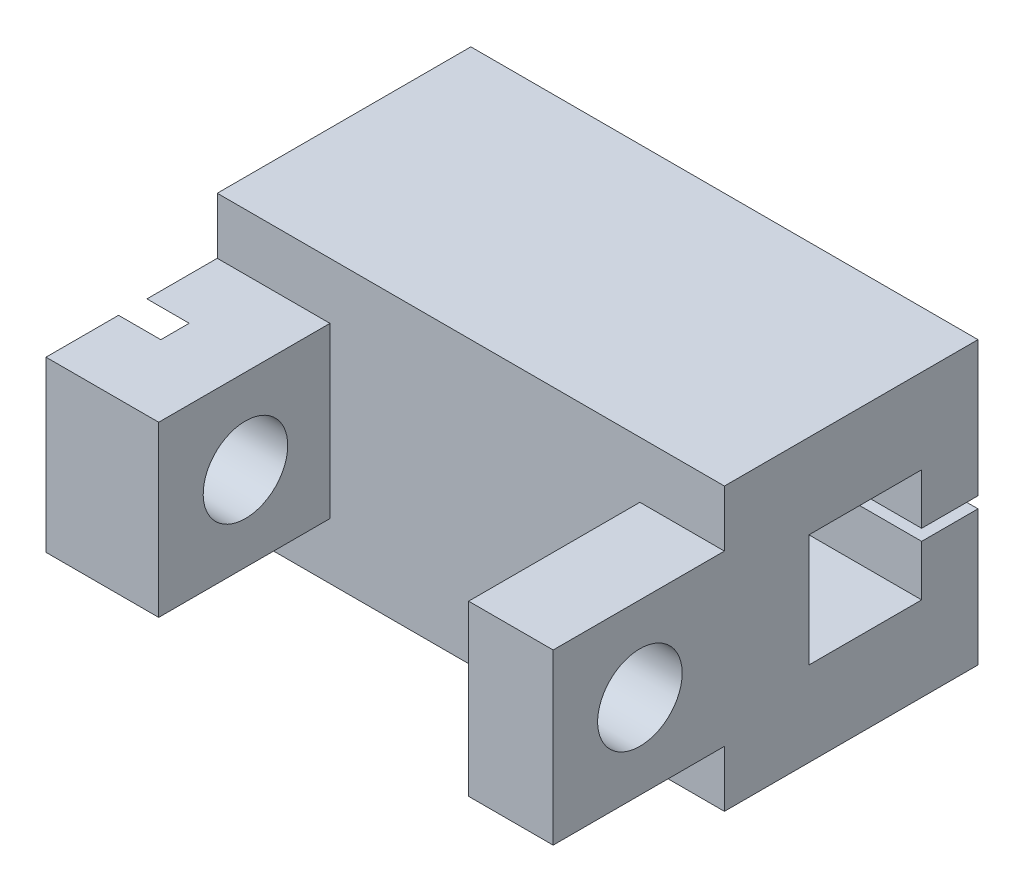
ISO-10303-21;
HEADER;
FILE_DESCRIPTION(('STEP AP214'),'2;1');
FILE_NAME('part.step','',(''),(''),'','','');
FILE_SCHEMA(('AUTOMOTIVE_DESIGN { 1 0 10303 214 1 1 1 1 }'));
ENDSEC;
DATA;
#1=APPLICATION_CONTEXT('core data for automotive mechanical design processes');
#2=APPLICATION_PROTOCOL_DEFINITION('international standard','automotive_design',2000,#1);
#3=PRODUCT_CONTEXT('',#1,'mechanical');
#4=PRODUCT('Part','Part','',(#3));
#5=PRODUCT_RELATED_PRODUCT_CATEGORY('part','',(#4));
#6=PRODUCT_DEFINITION_FORMATION('','',#4);
#7=PRODUCT_DEFINITION_CONTEXT('part definition',#1,'design');
#8=PRODUCT_DEFINITION('design','',#6,#7);
#9=PRODUCT_DEFINITION_SHAPE('','',#8);
#10=(LENGTH_UNIT() NAMED_UNIT(*) SI_UNIT(.MILLI.,.METRE.));
#11=(NAMED_UNIT(*) PLANE_ANGLE_UNIT() SI_UNIT($,.RADIAN.));
#12=(NAMED_UNIT(*) SI_UNIT($,.STERADIAN.) SOLID_ANGLE_UNIT());
#13=UNCERTAINTY_MEASURE_WITH_UNIT(LENGTH_MEASURE(1.E-05),#10,'distance_accuracy_value','');
#14=(GEOMETRIC_REPRESENTATION_CONTEXT(3) GLOBAL_UNCERTAINTY_ASSIGNED_CONTEXT((#13)) GLOBAL_UNIT_ASSIGNED_CONTEXT((#10,
#11,#12)) REPRESENTATION_CONTEXT('',''));
#15=CARTESIAN_POINT('',(0.,0.,0.));
#16=DIRECTION('',(0.,0.,1.));
#17=DIRECTION('',(1.,0.,0.));
#18=AXIS2_PLACEMENT_3D('',#15,#16,#17);
#19=CARTESIAN_POINT('',(0.,0.,0.));
#20=DIRECTION('',(0.,0.,1.));
#21=DIRECTION('',(1.,0.,0.));
#22=AXIS2_PLACEMENT_3D('',#19,#20,#21);
#23=PLANE('',#22);
#24=DIRECTION('',(0.,-1.,0.));
#25=VECTOR('',#24,1.);
#26=CARTESIAN_POINT('',(-7.9273578698866,1.7398119122257,0.));
#27=LINE('',#26,#25);
#28=CARTESIAN_POINT('',(-7.9273578698866,-1.2601880877743,0.));
#29=VERTEX_POINT('',#28);
#30=CARTESIAN_POINT('',(-7.9273578698866,-5.2601880877743,0.));
#31=VERTEX_POINT('',#30);
#32=EDGE_CURVE('E48',#29,#31,#27,.T.);
#33=ORIENTED_EDGE('',*,*,#32,.F.);
#34=DIRECTION('',(1.,0.,0.));
#35=VECTOR('',#34,1.);
#36=CARTESIAN_POINT('',(-7.9273578698866,-1.2601880877743,0.));
#37=LINE('',#36,#35);
#38=CARTESIAN_POINT('',(10.0726421301134,-1.2601880877743,0.));
#39=VERTEX_POINT('',#38);
#40=EDGE_CURVE('E243',#29,#39,#37,.T.);
#41=ORIENTED_EDGE('',*,*,#40,.T.);
#42=DIRECTION('',(0.,1.,0.));
#43=VECTOR('',#42,1.);
#44=CARTESIAN_POINT('',(10.0726421301134,1.7398119122257,0.));
#45=LINE('',#44,#43);
#46=CARTESIAN_POINT('',(10.0726421301134,-5.2601880877743,0.));
#47=VERTEX_POINT('',#46);
#48=EDGE_CURVE('E426',#47,#39,#45,.T.);
#49=ORIENTED_EDGE('',*,*,#48,.F.);
#50=DIRECTION('',(1.,0.,0.));
#51=VECTOR('',#50,1.);
#52=CARTESIAN_POINT('',(-7.9273578698866,-5.2601880877743,0.));
#53=LINE('',#52,#51);
#54=EDGE_CURVE('E290',#31,#47,#53,.T.);
#55=ORIENTED_EDGE('',*,*,#54,.F.);
#56=EDGE_LOOP('',(#33,#41,#49,#55));
#57=FACE_BOUND('',#56,.T.);
#58=ADVANCED_FACE('F33',(#57),#23,.F.);
#59=CARTESIAN_POINT('',(-7.9273578698866,1.7398119122257,3.));
#60=DIRECTION('',(1.,0.,0.));
#61=DIRECTION('',(0.,1.,0.));
#62=AXIS2_PLACEMENT_3D('',#59,#60,#61);
#63=PLANE('',#62);
#64=DIRECTION('',(0.,0.,-1.));
#65=VECTOR('',#64,1.);
#66=CARTESIAN_POINT('',(-7.9273578698866,-6.2601880877743,3.));
#67=LINE('',#66,#65);
#68=CARTESIAN_POINT('',(-7.9273578698866,-6.2601880877743,5.49542029223118));
#69=VERTEX_POINT('',#68);
#70=CARTESIAN_POINT('',(-7.9273578698866,-6.2601880877743,3.));
#71=VERTEX_POINT('',#70);
#72=EDGE_CURVE('E346',#69,#71,#67,.T.);
#73=ORIENTED_EDGE('',*,*,#72,.F.);
#74=DIRECTION('',(0.,-0.5,0.866025403784439));
#75=VECTOR('',#74,1.);
#76=CARTESIAN_POINT('',(-7.9273578698866,-4.90563635496473,3.14926786952454));
#77=LINE('',#76,#75);
#78=CARTESIAN_POINT('',(-7.9273578698866,-4.90563635496473,3.14926786952454));
#79=VERTEX_POINT('',#78);
#80=EDGE_CURVE('E293',#79,#69,#77,.T.);
#81=ORIENTED_EDGE('',*,*,#80,.F.);
#82=DIRECTION('',(0.,-1.,0.));
#83=VECTOR('',#82,1.);
#84=CARTESIAN_POINT('',(-7.9273578698866,-1.61473982058386,3.14926786952454));
#85=LINE('',#84,#83);
#86=CARTESIAN_POINT('',(-7.9273578698866,-1.61473982058386,3.14926786952454));
#87=VERTEX_POINT('',#86);
#88=EDGE_CURVE('E306',#87,#79,#85,.T.);
#89=ORIENTED_EDGE('',*,*,#88,.F.);
#90=DIRECTION('',(0.,-0.5,-0.866025403784439));
#91=VECTOR('',#90,1.);
#92=CARTESIAN_POINT('',(-7.9273578698866,0.0307084466065717,5.99926786952454));
#93=LINE('',#92,#91);
#94=CARTESIAN_POINT('',(-7.9273578698866,-0.260188087774299,5.49542029223116));
#95=VERTEX_POINT('',#94);
#96=EDGE_CURVE('E325',#95,#87,#93,.T.);
#97=ORIENTED_EDGE('',*,*,#96,.F.);
#98=DIRECTION('',(0.,0.,1.));
#99=VECTOR('',#98,1.);
#100=CARTESIAN_POINT('',(-7.9273578698866,-0.260188087774298,3.));
#101=LINE('',#100,#99);
#102=CARTESIAN_POINT('',(-7.9273578698866,-0.260188087774298,3.));
#103=VERTEX_POINT('',#102);
#104=EDGE_CURVE('E362',#103,#95,#101,.T.);
#105=ORIENTED_EDGE('',*,*,#104,.F.);
#106=DIRECTION('',(0.,-1.,0.));
#107=VECTOR('',#106,1.);
#108=CARTESIAN_POINT('',(-7.9273578698866,1.7398119122257,3.));
#109=LINE('',#108,#107);
#110=CARTESIAN_POINT('',(-7.9273578698866,1.7398119122257,3.));
#111=VERTEX_POINT('',#110);
#112=EDGE_CURVE('E412',#111,#103,#109,.T.);
#113=ORIENTED_EDGE('',*,*,#112,.F.);
#114=DIRECTION('',(0.,0.,-1.));
#115=VECTOR('',#114,1.);
#116=CARTESIAN_POINT('',(-7.9273578698866,1.7398119122257,3.));
#117=LINE('',#116,#115);
#118=CARTESIAN_POINT('',(-7.9273578698866,1.7398119122257,-6.));
#119=VERTEX_POINT('',#118);
#120=EDGE_CURVE('E424',#111,#119,#117,.T.);
#121=ORIENTED_EDGE('',*,*,#120,.T.);
#122=DIRECTION('',(0.,1.,0.));
#123=VECTOR('',#122,1.);
#124=CARTESIAN_POINT('',(-7.9273578698866,-1.2601880877743,-6.));
#125=LINE('',#124,#123);
#126=CARTESIAN_POINT('',(-7.9273578698866,-3.0601880877743,-6.));
#127=VERTEX_POINT('',#126);
#128=EDGE_CURVE('E231',#127,#119,#125,.T.);
#129=ORIENTED_EDGE('',*,*,#128,.F.);
#130=DIRECTION('',(0.,0.,-1.));
#131=VECTOR('',#130,1.);
#132=CARTESIAN_POINT('',(-7.9273578698866,-3.0601880877743,-6.));
#133=LINE('',#132,#131);
#134=CARTESIAN_POINT('',(-7.9273578698866,-3.0601880877743,-4.));
#135=VERTEX_POINT('',#134);
#136=EDGE_CURVE('E239',#135,#127,#133,.T.);
#137=ORIENTED_EDGE('',*,*,#136,.F.);
#138=DIRECTION('',(0.,-1.,0.));
#139=VECTOR('',#138,1.);
#140=CARTESIAN_POINT('',(-7.9273578698866,-1.2601880877743,-4.));
#141=LINE('',#140,#139);
#142=CARTESIAN_POINT('',(-7.9273578698866,-1.2601880877743,-4.));
#143=VERTEX_POINT('',#142);
#144=EDGE_CURVE('E224',#143,#135,#141,.T.);
#145=ORIENTED_EDGE('',*,*,#144,.F.);
#146=DIRECTION('',(0.,0.,-1.));
#147=VECTOR('',#146,1.);
#148=CARTESIAN_POINT('',(-7.9273578698866,-1.2601880877743,0.));
#149=LINE('',#148,#147);
#150=EDGE_CURVE('E236',#29,#143,#149,.T.);
#151=ORIENTED_EDGE('',*,*,#150,.F.);
#152=ORIENTED_EDGE('',*,*,#32,.T.);
#153=DIRECTION('',(0.,0.,1.));
#154=VECTOR('',#153,1.);
#155=CARTESIAN_POINT('',(-7.9273578698866,-5.2601880877743,0.));
#156=LINE('',#155,#154);
#157=CARTESIAN_POINT('',(-7.9273578698866,-5.2601880877743,-4.));
#158=VERTEX_POINT('',#157);
#159=EDGE_CURVE('E276',#158,#31,#156,.T.);
#160=ORIENTED_EDGE('',*,*,#159,.F.);
#161=DIRECTION('',(0.,-1.,0.));
#162=VECTOR('',#161,1.);
#163=CARTESIAN_POINT('',(-7.9273578698866,-5.2601880877743,-4.));
#164=LINE('',#163,#162);
#165=CARTESIAN_POINT('',(-7.9273578698866,-3.4601880877743,-4.));
#166=VERTEX_POINT('',#165);
#167=EDGE_CURVE('E273',#166,#158,#164,.T.);
#168=ORIENTED_EDGE('',*,*,#167,.F.);
#169=DIRECTION('',(0.,0.,1.));
#170=VECTOR('',#169,1.);
#171=CARTESIAN_POINT('',(-7.9273578698866,-3.4601880877743,-6.));
#172=LINE('',#171,#170);
#173=CARTESIAN_POINT('',(-7.9273578698866,-3.4601880877743,-6.));
#174=VERTEX_POINT('',#173);
#175=EDGE_CURVE('E269',#174,#166,#172,.T.);
#176=ORIENTED_EDGE('',*,*,#175,.F.);
#177=DIRECTION('',(0.,1.,0.));
#178=VECTOR('',#177,1.);
#179=CARTESIAN_POINT('',(-7.9273578698866,-8.2601880877743,-6.));
#180=LINE('',#179,#178);
#181=CARTESIAN_POINT('',(-7.9273578698866,-8.2601880877743,-6.));
#182=VERTEX_POINT('',#181);
#183=EDGE_CURVE('E267',#182,#174,#180,.T.);
#184=ORIENTED_EDGE('',*,*,#183,.F.);
#185=DIRECTION('',(0.,0.,-1.));
#186=VECTOR('',#185,1.);
#187=CARTESIAN_POINT('',(-7.9273578698866,-8.26018808777429,3.));
#188=LINE('',#187,#186);
#189=CARTESIAN_POINT('',(-7.9273578698866,-8.26018808777429,3.));
#190=VERTEX_POINT('',#189);
#191=EDGE_CURVE('E434',#190,#182,#188,.T.);
#192=ORIENTED_EDGE('',*,*,#191,.F.);
#193=EDGE_CURVE('E416',#71,#190,#109,.T.);
#194=ORIENTED_EDGE('',*,*,#193,.F.);
#195=EDGE_LOOP('',(#73,#81,#89,#97,#105,#113,#121,#129,#137,#145,#151,#152,#160,#168,#176,#184,
#192,#194));
#196=FACE_BOUND('',#195,.T.);
#197=ADVANCED_FACE('F235',(#196),#63,.F.);
#198=CARTESIAN_POINT('',(-3.9273578698866,-3.2601880877743,5.99926786952454));
#199=DIRECTION('',(-1.,0.,0.));
#200=DIRECTION('',(0.,0.,1.));
#201=AXIS2_PLACEMENT_3D('',#198,#199,#200);
#202=CYLINDRICAL_SURFACE('',#201,1.5);
#203=CARTESIAN_POINT('',(-3.9273578698866,-3.2601880877743,5.99926786952454));
#204=DIRECTION('',(1.,0.,0.));
#205=DIRECTION('',(0.,1.,0.));
#206=AXIS2_PLACEMENT_3D('',#203,#204,#205);
#207=CIRCLE('',#206,1.5);
#208=CARTESIAN_POINT('',(-3.9273578698866,-1.7601880877743,5.99926786952454));
#209=VERTEX_POINT('',#208);
#210=EDGE_CURVE('E343',#209,#209,#207,.T.);
#211=ORIENTED_EDGE('',*,*,#210,.T.);
#212=EDGE_LOOP('',(#211));
#213=FACE_BOUND('',#212,.T.);
#214=CARTESIAN_POINT('',(-6.4273578698866,-3.2601880877743,5.99926786952454));
#215=DIRECTION('',(-1.,0.,0.));
#216=DIRECTION('',(0.,-1.,0.));
#217=AXIS2_PLACEMENT_3D('',#214,#215,#216);
#218=CIRCLE('',#217,1.5);
#219=CARTESIAN_POINT('',(-6.4273578698866,-4.7601880877743,5.99926786952454));
#220=VERTEX_POINT('',#219);
#221=EDGE_CURVE('E331',#220,#220,#218,.T.);
#222=ORIENTED_EDGE('',*,*,#221,.T.);
#223=EDGE_LOOP('',(#222));
#224=FACE_BOUND('',#223,.T.);
#225=ADVANCED_FACE('F541',(#213,#224),#202,.F.);
#226=CARTESIAN_POINT('',(0.,0.,3.));
#227=DIRECTION('',(0.,0.,1.));
#228=DIRECTION('',(1.,0.,0.));
#229=AXIS2_PLACEMENT_3D('',#226,#227,#228);
#230=PLANE('',#229);
#231=DIRECTION('',(0.,1.,0.));
#232=VECTOR('',#231,1.);
#233=CARTESIAN_POINT('',(-3.9273578698866,1.7398119122257,3.));
#234=LINE('',#233,#232);
#235=CARTESIAN_POINT('',(-3.9273578698866,-6.2601880877743,3.));
#236=VERTEX_POINT('',#235);
#237=CARTESIAN_POINT('',(-3.9273578698866,-0.260188087774298,3.));
#238=VERTEX_POINT('',#237);
#239=EDGE_CURVE('E349',#236,#238,#234,.T.);
#240=ORIENTED_EDGE('',*,*,#239,.F.);
#241=DIRECTION('',(-1.,0.,0.));
#242=VECTOR('',#241,1.);
#243=CARTESIAN_POINT('',(-3.9273578698866,-6.2601880877743,3.));
#244=LINE('',#243,#242);
#245=EDGE_CURVE('E373',#236,#71,#244,.T.);
#246=ORIENTED_EDGE('',*,*,#245,.T.);
#247=ORIENTED_EDGE('',*,*,#193,.T.);
#248=DIRECTION('',(1.,0.,0.));
#249=VECTOR('',#248,1.);
#250=CARTESIAN_POINT('',(-7.9273578698866,-8.26018808777429,3.));
#251=LINE('',#250,#249);
#252=CARTESIAN_POINT('',(10.0726421301134,-8.26018808777429,3.));
#253=VERTEX_POINT('',#252);
#254=EDGE_CURVE('E415',#190,#253,#251,.T.);
#255=ORIENTED_EDGE('',*,*,#254,.T.);
#256=DIRECTION('',(0.,1.,0.));
#257=VECTOR('',#256,1.);
#258=CARTESIAN_POINT('',(10.0726421301134,1.7398119122257,3.));
#259=LINE('',#258,#257);
#260=CARTESIAN_POINT('',(10.0726421301134,-6.2601880877743,3.));
#261=VERTEX_POINT('',#260);
#262=EDGE_CURVE('E419',#253,#261,#259,.T.);
#263=ORIENTED_EDGE('',*,*,#262,.T.);
#264=DIRECTION('',(1.,0.,0.));
#265=VECTOR('',#264,1.);
#266=CARTESIAN_POINT('',(7.0726421301134,-6.2601880877743,3.));
#267=LINE('',#266,#265);
#268=CARTESIAN_POINT('',(7.0726421301134,-6.2601880877743,3.));
#269=VERTEX_POINT('',#268);
#270=EDGE_CURVE('E404',#269,#261,#267,.T.);
#271=ORIENTED_EDGE('',*,*,#270,.F.);
#272=DIRECTION('',(0.,1.,0.));
#273=VECTOR('',#272,1.);
#274=CARTESIAN_POINT('',(7.0726421301134,-6.2601880877743,3.));
#275=LINE('',#274,#273);
#276=CARTESIAN_POINT('',(7.0726421301134,-0.260188087774298,3.));
#277=VERTEX_POINT('',#276);
#278=EDGE_CURVE('E383',#269,#277,#275,.T.);
#279=ORIENTED_EDGE('',*,*,#278,.T.);
#280=DIRECTION('',(1.,0.,0.));
#281=VECTOR('',#280,1.);
#282=CARTESIAN_POINT('',(7.0726421301134,-0.260188087774298,3.));
#283=LINE('',#282,#281);
#284=CARTESIAN_POINT('',(10.0726421301134,-0.260188087774298,3.));
#285=VERTEX_POINT('',#284);
#286=EDGE_CURVE('E396',#277,#285,#283,.T.);
#287=ORIENTED_EDGE('',*,*,#286,.T.);
#288=CARTESIAN_POINT('',(10.0726421301134,1.7398119122257,3.));
#289=VERTEX_POINT('',#288);
#290=EDGE_CURVE('E418',#285,#289,#259,.T.);
#291=ORIENTED_EDGE('',*,*,#290,.T.);
#292=DIRECTION('',(-1.,0.,0.));
#293=VECTOR('',#292,1.);
#294=CARTESIAN_POINT('',(-7.9273578698866,1.7398119122257,3.));
#295=LINE('',#294,#293);
#296=EDGE_CURVE('E422',#289,#111,#295,.T.);
#297=ORIENTED_EDGE('',*,*,#296,.T.);
#298=ORIENTED_EDGE('',*,*,#112,.T.);
#299=DIRECTION('',(-1.,0.,0.));
#300=VECTOR('',#299,1.);
#301=CARTESIAN_POINT('',(-3.9273578698866,-0.260188087774298,3.));
#302=LINE('',#301,#300);
#303=EDGE_CURVE('E371',#238,#103,#302,.T.);
#304=ORIENTED_EDGE('',*,*,#303,.F.);
#305=EDGE_LOOP('',(#240,#246,#247,#255,#263,#271,#279,#287,#291,#297,#298,#304));
#306=FACE_BOUND('',#305,.T.);
#307=ADVANCED_FACE('F475',(#306),#230,.T.);
#308=CARTESIAN_POINT('',(-7.9273578698866,-0.260188087774299,6.50311544681791));
#309=VERTEX_POINT('',#308);
#310=CARTESIAN_POINT('',(-7.9273578698866,-0.260188087774299,9.0782020025658));
#311=VERTEX_POINT('',#310);
#312=EDGE_CURVE('E361',#309,#311,#101,.T.);
#313=ORIENTED_EDGE('',*,*,#312,.F.);
#314=DIRECTION('',(0.,0.5,-0.866025403784439));
#315=VECTOR('',#314,1.);
#316=CARTESIAN_POINT('',(-7.9273578698866,-1.61473982058386,8.84926786952454));
#317=LINE('',#316,#315);
#318=CARTESIAN_POINT('',(-7.9273578698866,-1.61473982058386,8.84926786952454));
#319=VERTEX_POINT('',#318);
#320=EDGE_CURVE('E323',#319,#309,#317,.T.);
#321=ORIENTED_EDGE('',*,*,#320,.F.);
#322=DIRECTION('',(0.,1.,0.));
#323=VECTOR('',#322,1.);
#324=CARTESIAN_POINT('',(-7.9273578698866,-4.90563635496473,8.84926786952454));
#325=LINE('',#324,#323);
#326=CARTESIAN_POINT('',(-7.9273578698866,-4.90563635496473,8.84926786952454));
#327=VERTEX_POINT('',#326);
#328=EDGE_CURVE('E320',#327,#319,#325,.T.);
#329=ORIENTED_EDGE('',*,*,#328,.F.);
#330=DIRECTION('',(0.,0.5,0.866025403784439));
#331=VECTOR('',#330,1.);
#332=CARTESIAN_POINT('',(-7.9273578698866,-6.55108462215516,5.99926786952454));
#333=LINE('',#332,#331);
#334=CARTESIAN_POINT('',(-7.9273578698866,-6.2601880877743,6.5031154468179));
#335=VERTEX_POINT('',#334);
#336=EDGE_CURVE('E318',#335,#327,#333,.T.);
#337=ORIENTED_EDGE('',*,*,#336,.F.);
#338=CARTESIAN_POINT('',(-7.9273578698866,-6.2601880877743,9.0782020025658));
#339=VERTEX_POINT('',#338);
#340=EDGE_CURVE('E358',#339,#335,#67,.T.);
#341=ORIENTED_EDGE('',*,*,#340,.F.);
#342=DIRECTION('',(0.,-1.,0.));
#343=VECTOR('',#342,1.);
#344=CARTESIAN_POINT('',(-7.9273578698866,1.7398119122257,9.0782020025658));
#345=LINE('',#344,#343);
#346=EDGE_CURVE('E350',#311,#339,#345,.T.);
#347=ORIENTED_EDGE('',*,*,#346,.F.);
#348=EDGE_LOOP('',(#313,#321,#329,#337,#341,#347));
#349=FACE_BOUND('',#348,.T.);
#350=ADVANCED_FACE('F35',(#349),#63,.F.);
#351=CARTESIAN_POINT('',(-7.9273578698866,-8.26018808777429,3.));
#352=DIRECTION('',(0.,1.,0.));
#353=DIRECTION('',(0.,0.,1.));
#354=AXIS2_PLACEMENT_3D('',#351,#352,#353);
#355=PLANE('',#354);
#356=ORIENTED_EDGE('',*,*,#191,.T.);
#357=DIRECTION('',(1.,0.,0.));
#358=VECTOR('',#357,1.);
#359=CARTESIAN_POINT('',(-7.9273578698866,-8.2601880877743,-6.));
#360=LINE('',#359,#358);
#361=CARTESIAN_POINT('',(10.0726421301134,-8.2601880877743,-6.));
#362=VERTEX_POINT('',#361);
#363=EDGE_CURVE('E279',#182,#362,#360,.T.);
#364=ORIENTED_EDGE('',*,*,#363,.T.);
#365=DIRECTION('',(0.,0.,-1.));
#366=VECTOR('',#365,1.);
#367=CARTESIAN_POINT('',(10.0726421301134,-8.26018808777429,3.));
#368=LINE('',#367,#366);
#369=EDGE_CURVE('E432',#253,#362,#368,.T.);
#370=ORIENTED_EDGE('',*,*,#369,.F.);
#371=ORIENTED_EDGE('',*,*,#254,.F.);
#372=EDGE_LOOP('',(#356,#364,#370,#371));
#373=FACE_BOUND('',#372,.T.);
#374=ADVANCED_FACE('F478',(#373),#355,.F.);
#375=CARTESIAN_POINT('',(10.0726421301134,1.7398119122257,3.));
#376=DIRECTION('',(-1.,0.,0.));
#377=DIRECTION('',(0.,-1.,0.));
#378=AXIS2_PLACEMENT_3D('',#375,#376,#377);
#379=PLANE('',#378);
#380=ORIENTED_EDGE('',*,*,#369,.T.);
#381=DIRECTION('',(0.,1.,0.));
#382=VECTOR('',#381,1.);
#383=CARTESIAN_POINT('',(10.0726421301134,-5.2601880877743,-6.));
#384=LINE('',#383,#382);
#385=CARTESIAN_POINT('',(10.0726421301134,-3.4601880877743,-6.));
#386=VERTEX_POINT('',#385);
#387=EDGE_CURVE('E259',#362,#386,#384,.T.);
#388=ORIENTED_EDGE('',*,*,#387,.T.);
#389=DIRECTION('',(0.,0.,1.));
#390=VECTOR('',#389,1.);
#391=CARTESIAN_POINT('',(10.0726421301134,-3.4601880877743,-6.));
#392=LINE('',#391,#390);
#393=CARTESIAN_POINT('',(10.0726421301134,-3.4601880877743,-4.));
#394=VERTEX_POINT('',#393);
#395=EDGE_CURVE('E282',#386,#394,#392,.T.);
#396=ORIENTED_EDGE('',*,*,#395,.T.);
#397=DIRECTION('',(0.,-1.,0.));
#398=VECTOR('',#397,1.);
#399=CARTESIAN_POINT('',(10.0726421301134,-5.2601880877743,-4.));
#400=LINE('',#399,#398);
#401=CARTESIAN_POINT('',(10.0726421301134,-5.2601880877743,-4.));
#402=VERTEX_POINT('',#401);
#403=EDGE_CURVE('E285',#394,#402,#400,.T.);
#404=ORIENTED_EDGE('',*,*,#403,.T.);
#405=DIRECTION('',(0.,0.,1.));
#406=VECTOR('',#405,1.);
#407=CARTESIAN_POINT('',(10.0726421301134,-5.2601880877743,0.));
#408=LINE('',#407,#406);
#409=EDGE_CURVE('E270',#402,#47,#408,.T.);
#410=ORIENTED_EDGE('',*,*,#409,.T.);
#411=ORIENTED_EDGE('',*,*,#48,.T.);
#412=DIRECTION('',(0.,0.,-1.));
#413=VECTOR('',#412,1.);
#414=CARTESIAN_POINT('',(10.0726421301134,-1.2601880877743,0.));
#415=LINE('',#414,#413);
#416=CARTESIAN_POINT('',(10.0726421301134,-1.2601880877743,-4.));
#417=VERTEX_POINT('',#416);
#418=EDGE_CURVE('E253',#39,#417,#415,.T.);
#419=ORIENTED_EDGE('',*,*,#418,.T.);
#420=DIRECTION('',(0.,-1.,0.));
#421=VECTOR('',#420,1.);
#422=CARTESIAN_POINT('',(10.0726421301134,-1.2601880877743,-4.));
#423=LINE('',#422,#421);
#424=CARTESIAN_POINT('',(10.0726421301134,-3.0601880877743,-4.));
#425=VERTEX_POINT('',#424);
#426=EDGE_CURVE('E226',#417,#425,#423,.T.);
#427=ORIENTED_EDGE('',*,*,#426,.T.);
#428=DIRECTION('',(0.,0.,-1.));
#429=VECTOR('',#428,1.);
#430=CARTESIAN_POINT('',(10.0726421301134,-3.0601880877743,-6.));
#431=LINE('',#430,#429);
#432=CARTESIAN_POINT('',(10.0726421301134,-3.0601880877743,-6.));
#433=VERTEX_POINT('',#432);
#434=EDGE_CURVE('E247',#425,#433,#431,.T.);
#435=ORIENTED_EDGE('',*,*,#434,.T.);
#436=DIRECTION('',(0.,1.,0.));
#437=VECTOR('',#436,1.);
#438=CARTESIAN_POINT('',(10.0726421301134,1.7398119122257,-6.));
#439=LINE('',#438,#437);
#440=CARTESIAN_POINT('',(10.0726421301134,1.7398119122257,-6.));
#441=VERTEX_POINT('',#440);
#442=EDGE_CURVE('E244',#433,#441,#439,.T.);
#443=ORIENTED_EDGE('',*,*,#442,.T.);
#444=DIRECTION('',(0.,0.,-1.));
#445=VECTOR('',#444,1.);
#446=CARTESIAN_POINT('',(10.0726421301134,1.7398119122257,3.));
#447=LINE('',#446,#445);
#448=EDGE_CURVE('E430',#289,#441,#447,.T.);
#449=ORIENTED_EDGE('',*,*,#448,.F.);
#450=ORIENTED_EDGE('',*,*,#290,.F.);
#451=DIRECTION('',(0.,0.,1.));
#452=VECTOR('',#451,1.);
#453=CARTESIAN_POINT('',(10.0726421301134,-0.260188087774298,3.));
#454=LINE('',#453,#452);
#455=CARTESIAN_POINT('',(10.0726421301134,-0.260188087774299,9.0782020025658));
#456=VERTEX_POINT('',#455);
#457=EDGE_CURVE('E380',#285,#456,#454,.T.);
#458=ORIENTED_EDGE('',*,*,#457,.T.);
#459=DIRECTION('',(0.,-1.,0.));
#460=VECTOR('',#459,1.);
#461=CARTESIAN_POINT('',(10.0726421301134,-6.2601880877743,9.0782020025658));
#462=LINE('',#461,#460);
#463=CARTESIAN_POINT('',(10.0726421301134,-6.2601880877743,9.0782020025658));
#464=VERTEX_POINT('',#463);
#465=EDGE_CURVE('E399',#456,#464,#462,.T.);
#466=ORIENTED_EDGE('',*,*,#465,.T.);
#467=DIRECTION('',(0.,0.,-1.));
#468=VECTOR('',#467,1.);
#469=CARTESIAN_POINT('',(10.0726421301134,-6.2601880877743,3.));
#470=LINE('',#469,#468);
#471=EDGE_CURVE('E387',#464,#261,#470,.T.);
#472=ORIENTED_EDGE('',*,*,#471,.T.);
#473=ORIENTED_EDGE('',*,*,#262,.F.);
#474=EDGE_LOOP('',(#380,#388,#396,#404,#410,#411,#419,#427,#435,#443,#449,#450,#458,#466,#472,#473));
#475=FACE_BOUND('',#474,.T.);
#476=CARTESIAN_POINT('',(10.0726421301134,-3.2601880877743,5.99926786952454));
#477=DIRECTION('',(1.,0.,0.));
#478=DIRECTION('',(0.,0.,-1.));
#479=AXIS2_PLACEMENT_3D('',#476,#477,#478);
#480=CIRCLE('',#479,1.5);
#481=CARTESIAN_POINT('',(10.0726421301134,-3.2601880877743,4.49926786952454));
#482=VERTEX_POINT('',#481);
#483=EDGE_CURVE('E376',#482,#482,#480,.T.);
#484=ORIENTED_EDGE('',*,*,#483,.F.);
#485=EDGE_LOOP('',(#484));
#486=FACE_BOUND('',#485,.T.);
#487=ADVANCED_FACE('F483',(#475,#486),#379,.F.);
#488=CARTESIAN_POINT('',(-7.9273578698866,1.7398119122257,3.));
#489=DIRECTION('',(0.,-1.,0.));
#490=DIRECTION('',(0.,0.,-1.));
#491=AXIS2_PLACEMENT_3D('',#488,#489,#490);
#492=PLANE('',#491);
#493=ORIENTED_EDGE('',*,*,#448,.T.);
#494=DIRECTION('',(1.,0.,0.));
#495=VECTOR('',#494,1.);
#496=CARTESIAN_POINT('',(-7.9273578698866,1.7398119122257,-6.));
#497=LINE('',#496,#495);
#498=EDGE_CURVE('E260',#119,#441,#497,.T.);
#499=ORIENTED_EDGE('',*,*,#498,.F.);
#500=ORIENTED_EDGE('',*,*,#120,.F.);
#501=ORIENTED_EDGE('',*,*,#296,.F.);
#502=EDGE_LOOP('',(#493,#499,#500,#501));
#503=FACE_BOUND('',#502,.T.);
#504=ADVANCED_FACE('F503',(#503),#492,.F.);
#505=CARTESIAN_POINT('',(7.0726421301134,-6.2601880877743,3.));
#506=DIRECTION('',(0.,-1.,0.));
#507=DIRECTION('',(0.,0.,-1.));
#508=AXIS2_PLACEMENT_3D('',#505,#506,#507);
#509=PLANE('',#508);
#510=ORIENTED_EDGE('',*,*,#471,.F.);
#511=DIRECTION('',(1.,0.,0.));
#512=VECTOR('',#511,1.);
#513=CARTESIAN_POINT('',(7.0726421301134,-6.2601880877743,9.0782020025658));
#514=LINE('',#513,#512);
#515=CARTESIAN_POINT('',(7.0726421301134,-6.2601880877743,9.0782020025658));
#516=VERTEX_POINT('',#515);
#517=EDGE_CURVE('E406',#516,#464,#514,.T.);
#518=ORIENTED_EDGE('',*,*,#517,.F.);
#519=DIRECTION('',(0.,0.,-1.));
#520=VECTOR('',#519,1.);
#521=CARTESIAN_POINT('',(7.0726421301134,-6.2601880877743,3.));
#522=LINE('',#521,#520);
#523=EDGE_CURVE('E393',#516,#269,#522,.T.);
#524=ORIENTED_EDGE('',*,*,#523,.T.);
#525=ORIENTED_EDGE('',*,*,#270,.T.);
#526=EDGE_LOOP('',(#510,#518,#524,#525));
#527=FACE_BOUND('',#526,.T.);
#528=ADVANCED_FACE('F488',(#527),#509,.T.);
#529=CARTESIAN_POINT('',(7.0726421301134,-6.2601880877743,9.0782020025658));
#530=DIRECTION('',(0.,0.,1.));
#531=DIRECTION('',(1.,0.,0.));
#532=AXIS2_PLACEMENT_3D('',#529,#530,#531);
#533=PLANE('',#532);
#534=ORIENTED_EDGE('',*,*,#465,.F.);
#535=DIRECTION('',(1.,0.,0.));
#536=VECTOR('',#535,1.);
#537=CARTESIAN_POINT('',(7.0726421301134,-0.260188087774299,9.0782020025658));
#538=LINE('',#537,#536);
#539=CARTESIAN_POINT('',(7.0726421301134,-0.260188087774299,9.0782020025658));
#540=VERTEX_POINT('',#539);
#541=EDGE_CURVE('E408',#540,#456,#538,.T.);
#542=ORIENTED_EDGE('',*,*,#541,.F.);
#543=DIRECTION('',(0.,-1.,0.));
#544=VECTOR('',#543,1.);
#545=CARTESIAN_POINT('',(7.0726421301134,-6.2601880877743,9.0782020025658));
#546=LINE('',#545,#544);
#547=EDGE_CURVE('E390',#540,#516,#546,.T.);
#548=ORIENTED_EDGE('',*,*,#547,.T.);
#549=ORIENTED_EDGE('',*,*,#517,.T.);
#550=EDGE_LOOP('',(#534,#542,#548,#549));
#551=FACE_BOUND('',#550,.T.);
#552=ADVANCED_FACE('F583',(#551),#533,.T.);
#553=CARTESIAN_POINT('',(7.0726421301134,-0.260188087774298,3.));
#554=DIRECTION('',(0.,1.,0.));
#555=DIRECTION('',(0.,0.,1.));
#556=AXIS2_PLACEMENT_3D('',#553,#554,#555);
#557=PLANE('',#556);
#558=ORIENTED_EDGE('',*,*,#457,.F.);
#559=ORIENTED_EDGE('',*,*,#286,.F.);
#560=DIRECTION('',(0.,0.,1.));
#561=VECTOR('',#560,1.);
#562=CARTESIAN_POINT('',(7.0726421301134,-0.260188087774298,3.));
#563=LINE('',#562,#561);
#564=EDGE_CURVE('E386',#277,#540,#563,.T.);
#565=ORIENTED_EDGE('',*,*,#564,.T.);
#566=ORIENTED_EDGE('',*,*,#541,.T.);
#567=EDGE_LOOP('',(#558,#559,#565,#566));
#568=FACE_BOUND('',#567,.T.);
#569=ADVANCED_FACE('F495',(#568),#557,.T.);
#570=CARTESIAN_POINT('',(7.0726421301134,0.,0.));
#571=DIRECTION('',(1.,0.,0.));
#572=DIRECTION('',(0.,0.,-1.));
#573=AXIS2_PLACEMENT_3D('',#570,#571,#572);
#574=PLANE('',#573);
#575=CARTESIAN_POINT('',(7.0726421301134,-3.2601880877743,5.99926786952454));
#576=DIRECTION('',(1.,0.,0.));
#577=DIRECTION('',(0.,0.,-1.));
#578=AXIS2_PLACEMENT_3D('',#575,#576,#577);
#579=CIRCLE('',#578,1.5);
#580=CARTESIAN_POINT('',(7.0726421301134,-3.2601880877743,4.49926786952454));
#581=VERTEX_POINT('',#580);
#582=EDGE_CURVE('E377',#581,#581,#579,.T.);
#583=ORIENTED_EDGE('',*,*,#582,.T.);
#584=EDGE_LOOP('',(#583));
#585=FACE_BOUND('',#584,.T.);
#586=ORIENTED_EDGE('',*,*,#278,.F.);
#587=ORIENTED_EDGE('',*,*,#523,.F.);
#588=ORIENTED_EDGE('',*,*,#547,.F.);
#589=ORIENTED_EDGE('',*,*,#564,.F.);
#590=EDGE_LOOP('',(#586,#587,#588,#589));
#591=FACE_BOUND('',#590,.T.);
#592=ADVANCED_FACE('F492',(#585,#591),#574,.F.);
#593=CARTESIAN_POINT('',(7.0726421301134,-3.2601880877743,5.99926786952454));
#594=DIRECTION('',(1.,0.,0.));
#595=DIRECTION('',(0.,0.,-1.));
#596=AXIS2_PLACEMENT_3D('',#593,#594,#595);
#597=CYLINDRICAL_SURFACE('',#596,1.5);
#598=ORIENTED_EDGE('',*,*,#582,.F.);
#599=EDGE_LOOP('',(#598));
#600=FACE_BOUND('',#599,.T.);
#601=ORIENTED_EDGE('',*,*,#483,.T.);
#602=EDGE_LOOP('',(#601));
#603=FACE_BOUND('',#602,.T.);
#604=ADVANCED_FACE('F568',(#600,#603),#597,.F.);
#605=CARTESIAN_POINT('',(-3.9273578698866,0.,0.));
#606=DIRECTION('',(1.,0.,0.));
#607=DIRECTION('',(0.,1.,0.));
#608=AXIS2_PLACEMENT_3D('',#605,#606,#607);
#609=PLANE('',#608);
#610=DIRECTION('',(0.,0.,-1.));
#611=VECTOR('',#610,1.);
#612=CARTESIAN_POINT('',(-3.9273578698866,-6.2601880877743,3.));
#613=LINE('',#612,#611);
#614=CARTESIAN_POINT('',(-3.9273578698866,-6.2601880877743,9.0782020025658));
#615=VERTEX_POINT('',#614);
#616=EDGE_CURVE('E347',#615,#236,#613,.T.);
#617=ORIENTED_EDGE('',*,*,#616,.T.);
#618=ORIENTED_EDGE('',*,*,#239,.T.);
#619=DIRECTION('',(0.,0.,1.));
#620=VECTOR('',#619,1.);
#621=CARTESIAN_POINT('',(-3.9273578698866,-0.260188087774298,3.));
#622=LINE('',#621,#620);
#623=CARTESIAN_POINT('',(-3.9273578698866,-0.260188087774299,9.0782020025658));
#624=VERTEX_POINT('',#623);
#625=EDGE_CURVE('E353',#238,#624,#622,.T.);
#626=ORIENTED_EDGE('',*,*,#625,.T.);
#627=DIRECTION('',(0.,-1.,0.));
#628=VECTOR('',#627,1.);
#629=CARTESIAN_POINT('',(-3.9273578698866,1.7398119122257,9.0782020025658));
#630=LINE('',#629,#628);
#631=EDGE_CURVE('E355',#624,#615,#630,.T.);
#632=ORIENTED_EDGE('',*,*,#631,.T.);
#633=EDGE_LOOP('',(#617,#618,#626,#632));
#634=FACE_BOUND('',#633,.T.);
#635=ORIENTED_EDGE('',*,*,#210,.F.);
#636=EDGE_LOOP('',(#635));
#637=FACE_BOUND('',#636,.T.);
#638=ADVANCED_FACE('F514',(#634,#637),#609,.T.);
#639=CARTESIAN_POINT('',(-3.9273578698866,-6.2601880877743,3.));
#640=DIRECTION('',(0.,1.,0.));
#641=DIRECTION('',(0.,0.,1.));
#642=AXIS2_PLACEMENT_3D('',#639,#640,#641);
#643=PLANE('',#642);
#644=DIRECTION('',(0.,0.,1.));
#645=VECTOR('',#644,1.);
#646=CARTESIAN_POINT('',(-6.4273578698866,-6.2601880877743,3.));
#647=LINE('',#646,#645);
#648=CARTESIAN_POINT('',(-6.4273578698866,-6.2601880877743,5.49542029223118));
#649=VERTEX_POINT('',#648);
#650=CARTESIAN_POINT('',(-6.4273578698866,-6.2601880877743,6.5031154468179));
#651=VERTEX_POINT('',#650);
#652=EDGE_CURVE('E341',#649,#651,#647,.T.);
#653=ORIENTED_EDGE('',*,*,#652,.F.);
#654=DIRECTION('',(-1.,0.,0.));
#655=VECTOR('',#654,1.);
#656=CARTESIAN_POINT('',(-3.9273578698866,-6.2601880877743,5.49542029223118));
#657=LINE('',#656,#655);
#658=EDGE_CURVE('E11',#649,#69,#657,.T.);
#659=ORIENTED_EDGE('',*,*,#658,.T.);
#660=ORIENTED_EDGE('',*,*,#72,.T.);
#661=ORIENTED_EDGE('',*,*,#245,.F.);
#662=ORIENTED_EDGE('',*,*,#616,.F.);
#663=DIRECTION('',(-1.,0.,0.));
#664=VECTOR('',#663,1.);
#665=CARTESIAN_POINT('',(-3.9273578698866,-6.2601880877743,9.0782020025658));
#666=LINE('',#665,#664);
#667=EDGE_CURVE('E357',#615,#339,#666,.T.);
#668=ORIENTED_EDGE('',*,*,#667,.T.);
#669=ORIENTED_EDGE('',*,*,#340,.T.);
#670=DIRECTION('',(1.,0.,0.));
#671=VECTOR('',#670,1.);
#672=CARTESIAN_POINT('',(-3.9273578698866,-6.2601880877743,6.5031154468179));
#673=LINE('',#672,#671);
#674=EDGE_CURVE('E41',#335,#651,#673,.T.);
#675=ORIENTED_EDGE('',*,*,#674,.T.);
#676=EDGE_LOOP('',(#653,#659,#660,#661,#662,#668,#669,#675));
#677=FACE_BOUND('',#676,.T.);
#678=ADVANCED_FACE('F446',(#677),#643,.F.);
#679=CARTESIAN_POINT('',(-3.9273578698866,-0.260188087774298,3.));
#680=DIRECTION('',(0.,-1.,0.));
#681=DIRECTION('',(0.,0.,-1.));
#682=AXIS2_PLACEMENT_3D('',#679,#680,#681);
#683=PLANE('',#682);
#684=ORIENTED_EDGE('',*,*,#104,.T.);
#685=DIRECTION('',(1.,0.,0.));
#686=VECTOR('',#685,1.);
#687=CARTESIAN_POINT('',(-3.9273578698866,-0.260188087774299,5.49542029223116));
#688=LINE('',#687,#686);
#689=CARTESIAN_POINT('',(-6.4273578698866,-0.260188087774299,5.49542029223116));
#690=VERTEX_POINT('',#689);
#691=EDGE_CURVE('E441',#95,#690,#688,.T.);
#692=ORIENTED_EDGE('',*,*,#691,.T.);
#693=DIRECTION('',(0.,0.,-1.));
#694=VECTOR('',#693,1.);
#695=CARTESIAN_POINT('',(-6.42735786988661,-0.260188087774298,3.));
#696=LINE('',#695,#694);
#697=CARTESIAN_POINT('',(-6.4273578698866,-0.260188087774299,6.50311544681791));
#698=VERTEX_POINT('',#697);
#699=EDGE_CURVE('E339',#698,#690,#696,.T.);
#700=ORIENTED_EDGE('',*,*,#699,.F.);
#701=DIRECTION('',(-1.,0.,0.));
#702=VECTOR('',#701,1.);
#703=CARTESIAN_POINT('',(-3.9273578698866,-0.260188087774299,6.50311544681791));
#704=LINE('',#703,#702);
#705=EDGE_CURVE('E436',#698,#309,#704,.T.);
#706=ORIENTED_EDGE('',*,*,#705,.T.);
#707=ORIENTED_EDGE('',*,*,#312,.T.);
#708=DIRECTION('',(-1.,0.,0.));
#709=VECTOR('',#708,1.);
#710=CARTESIAN_POINT('',(-3.9273578698866,-0.260188087774299,9.0782020025658));
#711=LINE('',#710,#709);
#712=EDGE_CURVE('E368',#624,#311,#711,.T.);
#713=ORIENTED_EDGE('',*,*,#712,.F.);
#714=ORIENTED_EDGE('',*,*,#625,.F.);
#715=ORIENTED_EDGE('',*,*,#303,.T.);
#716=EDGE_LOOP('',(#684,#692,#700,#706,#707,#713,#714,#715));
#717=FACE_BOUND('',#716,.T.);
#718=ADVANCED_FACE('F509',(#717),#683,.F.);
#719=CARTESIAN_POINT('',(-3.9273578698866,1.7398119122257,9.0782020025658));
#720=DIRECTION('',(0.,0.,-1.));
#721=DIRECTION('',(-1.,0.,0.));
#722=AXIS2_PLACEMENT_3D('',#719,#720,#721);
#723=PLANE('',#722);
#724=ORIENTED_EDGE('',*,*,#346,.T.);
#725=ORIENTED_EDGE('',*,*,#667,.F.);
#726=ORIENTED_EDGE('',*,*,#631,.F.);
#727=ORIENTED_EDGE('',*,*,#712,.T.);
#728=EDGE_LOOP('',(#724,#725,#726,#727));
#729=FACE_BOUND('',#728,.T.);
#730=ADVANCED_FACE('F519',(#729),#723,.F.);
#731=CARTESIAN_POINT('',(-6.4273578698866,-4.90563635496473,3.14926786952454));
#732=DIRECTION('',(0.,-0.866025403784438,-0.5));
#733=DIRECTION('',(0.,0.5,-0.866025403784439));
#734=AXIS2_PLACEMENT_3D('',#731,#732,#733);
#735=PLANE('',#734);
#736=DIRECTION('',(0.,-0.5,0.866025403784439));
#737=VECTOR('',#736,1.);
#738=CARTESIAN_POINT('',(-6.4273578698866,-4.90563635496473,3.14926786952454));
#739=LINE('',#738,#737);
#740=CARTESIAN_POINT('',(-6.4273578698866,-4.90563635496473,3.14926786952454));
#741=VERTEX_POINT('',#740);
#742=EDGE_CURVE('E302',#741,#649,#739,.T.);
#743=ORIENTED_EDGE('',*,*,#742,.F.);
#744=DIRECTION('',(-1.,0.,0.));
#745=VECTOR('',#744,1.);
#746=CARTESIAN_POINT('',(-6.4273578698866,-4.90563635496473,3.14926786952454));
#747=LINE('',#746,#745);
#748=EDGE_CURVE('E329',#741,#79,#747,.T.);
#749=ORIENTED_EDGE('',*,*,#748,.T.);
#750=ORIENTED_EDGE('',*,*,#80,.T.);
#751=ORIENTED_EDGE('',*,*,#658,.F.);
#752=EDGE_LOOP('',(#743,#749,#750,#751));
#753=FACE_BOUND('',#752,.T.);
#754=ADVANCED_FACE('F465',(#753),#735,.F.);
#755=CARTESIAN_POINT('',(-6.4273578698866,-6.55108462215516,5.99926786952454));
#756=DIRECTION('',(0.,-0.866025403784439,0.5));
#757=DIRECTION('',(0.,-0.5,-0.866025403784439));
#758=AXIS2_PLACEMENT_3D('',#755,#756,#757);
#759=PLANE('',#758);
#760=ORIENTED_EDGE('',*,*,#336,.T.);
#761=DIRECTION('',(-1.,0.,0.));
#762=VECTOR('',#761,1.);
#763=CARTESIAN_POINT('',(-6.4273578698866,-4.90563635496473,8.84926786952454));
#764=LINE('',#763,#762);
#765=CARTESIAN_POINT('',(-6.4273578698866,-4.90563635496473,8.84926786952454));
#766=VERTEX_POINT('',#765);
#767=EDGE_CURVE('E316',#766,#327,#764,.T.);
#768=ORIENTED_EDGE('',*,*,#767,.F.);
#769=DIRECTION('',(0.,0.5,0.866025403784439));
#770=VECTOR('',#769,1.);
#771=CARTESIAN_POINT('',(-6.4273578698866,-6.55108462215516,5.99926786952454));
#772=LINE('',#771,#770);
#773=EDGE_CURVE('E305',#651,#766,#772,.T.);
#774=ORIENTED_EDGE('',*,*,#773,.F.);
#775=ORIENTED_EDGE('',*,*,#674,.F.);
#776=EDGE_LOOP('',(#760,#768,#774,#775));
#777=FACE_BOUND('',#776,.T.);
#778=ADVANCED_FACE('F451',(#777),#759,.F.);
#779=CARTESIAN_POINT('',(-6.4273578698866,0.030708446606572,5.99926786952454));
#780=DIRECTION('',(0.,0.866025403784439,-0.5));
#781=DIRECTION('',(0.,0.5,0.866025403784439));
#782=AXIS2_PLACEMENT_3D('',#779,#780,#781);
#783=PLANE('',#782);
#784=ORIENTED_EDGE('',*,*,#96,.T.);
#785=DIRECTION('',(-1.,0.,0.));
#786=VECTOR('',#785,1.);
#787=CARTESIAN_POINT('',(-6.4273578698866,-1.61473982058386,3.14926786952454));
#788=LINE('',#787,#786);
#789=CARTESIAN_POINT('',(-6.4273578698866,-1.61473982058386,3.14926786952454));
#790=VERTEX_POINT('',#789);
#791=EDGE_CURVE('E332',#790,#87,#788,.T.);
#792=ORIENTED_EDGE('',*,*,#791,.F.);
#793=DIRECTION('',(0.,-0.5,-0.866025403784439));
#794=VECTOR('',#793,1.);
#795=CARTESIAN_POINT('',(-6.4273578698866,0.030708446606572,5.99926786952454));
#796=LINE('',#795,#794);
#797=EDGE_CURVE('E311',#690,#790,#796,.T.);
#798=ORIENTED_EDGE('',*,*,#797,.F.);
#799=ORIENTED_EDGE('',*,*,#691,.F.);
#800=EDGE_LOOP('',(#784,#792,#798,#799));
#801=FACE_BOUND('',#800,.T.);
#802=ADVANCED_FACE('F523',(#801),#783,.F.);
#803=CARTESIAN_POINT('',(-6.4273578698866,-1.61473982058386,8.84926786952454));
#804=DIRECTION('',(0.,0.866025403784439,0.5));
#805=DIRECTION('',(0.,-0.5,0.866025403784439));
#806=AXIS2_PLACEMENT_3D('',#803,#804,#805);
#807=PLANE('',#806);
#808=DIRECTION('',(0.,0.5,-0.866025403784439));
#809=VECTOR('',#808,1.);
#810=CARTESIAN_POINT('',(-6.4273578698866,-1.61473982058386,8.84926786952454));
#811=LINE('',#810,#809);
#812=CARTESIAN_POINT('',(-6.4273578698866,-1.61473982058386,8.84926786952454));
#813=VERTEX_POINT('',#812);
#814=EDGE_CURVE('E56',#813,#698,#811,.T.);
#815=ORIENTED_EDGE('',*,*,#814,.F.);
#816=DIRECTION('',(-1.,0.,0.));
#817=VECTOR('',#816,1.);
#818=CARTESIAN_POINT('',(-6.4273578698866,-1.61473982058386,8.84926786952454));
#819=LINE('',#818,#817);
#820=EDGE_CURVE('E335',#813,#319,#819,.T.);
#821=ORIENTED_EDGE('',*,*,#820,.T.);
#822=ORIENTED_EDGE('',*,*,#320,.T.);
#823=ORIENTED_EDGE('',*,*,#705,.F.);
#824=EDGE_LOOP('',(#815,#821,#822,#823));
#825=FACE_BOUND('',#824,.T.);
#826=ADVANCED_FACE('F521',(#825),#807,.F.);
#827=CARTESIAN_POINT('',(-6.42735786988661,0.,0.));
#828=DIRECTION('',(-1.,0.,0.));
#829=DIRECTION('',(0.,-1.,0.));
#830=AXIS2_PLACEMENT_3D('',#827,#828,#829);
#831=PLANE('',#830);
#832=ORIENTED_EDGE('',*,*,#221,.F.);
#833=EDGE_LOOP('',(#832));
#834=FACE_BOUND('',#833,.T.);
#835=ORIENTED_EDGE('',*,*,#652,.T.);
#836=ORIENTED_EDGE('',*,*,#773,.T.);
#837=DIRECTION('',(0.,1.,0.));
#838=VECTOR('',#837,1.);
#839=CARTESIAN_POINT('',(-6.4273578698866,-4.90563635496473,8.84926786952454));
#840=LINE('',#839,#838);
#841=EDGE_CURVE('E308',#766,#813,#840,.T.);
#842=ORIENTED_EDGE('',*,*,#841,.T.);
#843=ORIENTED_EDGE('',*,*,#814,.T.);
#844=ORIENTED_EDGE('',*,*,#699,.T.);
#845=ORIENTED_EDGE('',*,*,#797,.T.);
#846=DIRECTION('',(0.,-1.,0.));
#847=VECTOR('',#846,1.);
#848=CARTESIAN_POINT('',(-6.4273578698866,-1.61473982058386,3.14926786952454));
#849=LINE('',#848,#847);
#850=EDGE_CURVE('E313',#790,#741,#849,.T.);
#851=ORIENTED_EDGE('',*,*,#850,.T.);
#852=ORIENTED_EDGE('',*,*,#742,.T.);
#853=EDGE_LOOP('',(#835,#836,#842,#843,#844,#845,#851,#852));
#854=FACE_BOUND('',#853,.T.);
#855=ADVANCED_FACE('F461',(#834,#854),#831,.T.);
#856=CARTESIAN_POINT('',(-6.4273578698866,-1.61473982058386,3.14926786952454));
#857=DIRECTION('',(0.,0.,-1.));
#858=DIRECTION('',(0.,1.,0.));
#859=AXIS2_PLACEMENT_3D('',#856,#857,#858);
#860=PLANE('',#859);
#861=ORIENTED_EDGE('',*,*,#88,.T.);
#862=ORIENTED_EDGE('',*,*,#748,.F.);
#863=ORIENTED_EDGE('',*,*,#850,.F.);
#864=ORIENTED_EDGE('',*,*,#791,.T.);
#865=EDGE_LOOP('',(#861,#862,#863,#864));
#866=FACE_BOUND('',#865,.T.);
#867=ADVANCED_FACE('F529',(#866),#860,.F.);
#868=CARTESIAN_POINT('',(-6.4273578698866,-4.90563635496473,8.84926786952454));
#869=DIRECTION('',(0.,0.,1.));
#870=DIRECTION('',(1.,0.,0.));
#871=AXIS2_PLACEMENT_3D('',#868,#869,#870);
#872=PLANE('',#871);
#873=ORIENTED_EDGE('',*,*,#328,.T.);
#874=ORIENTED_EDGE('',*,*,#820,.F.);
#875=ORIENTED_EDGE('',*,*,#841,.F.);
#876=ORIENTED_EDGE('',*,*,#767,.T.);
#877=EDGE_LOOP('',(#873,#874,#875,#876));
#878=FACE_BOUND('',#877,.T.);
#879=ADVANCED_FACE('F459',(#878),#872,.F.);
#880=CARTESIAN_POINT('',(-7.9273578698866,-5.2601880877743,0.));
#881=DIRECTION('',(0.,1.,0.));
#882=DIRECTION('',(0.,0.,1.));
#883=AXIS2_PLACEMENT_3D('',#880,#881,#882);
#884=PLANE('',#883);
#885=ORIENTED_EDGE('',*,*,#409,.F.);
#886=DIRECTION('',(1.,0.,0.));
#887=VECTOR('',#886,1.);
#888=CARTESIAN_POINT('',(-7.9273578698866,-5.2601880877743,-4.));
#889=LINE('',#888,#887);
#890=EDGE_CURVE('E294',#158,#402,#889,.T.);
#891=ORIENTED_EDGE('',*,*,#890,.F.);
#892=ORIENTED_EDGE('',*,*,#159,.T.);
#893=ORIENTED_EDGE('',*,*,#54,.T.);
#894=EDGE_LOOP('',(#885,#891,#892,#893));
#895=FACE_BOUND('',#894,.T.);
#896=ADVANCED_FACE('F656',(#895),#884,.T.);
#897=CARTESIAN_POINT('',(-7.9273578698866,-5.2601880877743,-4.));
#898=DIRECTION('',(0.,0.,1.));
#899=DIRECTION('',(1.,0.,0.));
#900=AXIS2_PLACEMENT_3D('',#897,#898,#899);
#901=PLANE('',#900);
#902=ORIENTED_EDGE('',*,*,#403,.F.);
#903=DIRECTION('',(1.,0.,0.));
#904=VECTOR('',#903,1.);
#905=CARTESIAN_POINT('',(-7.9273578698866,-3.4601880877743,-4.));
#906=LINE('',#905,#904);
#907=EDGE_CURVE('E296',#166,#394,#906,.T.);
#908=ORIENTED_EDGE('',*,*,#907,.F.);
#909=ORIENTED_EDGE('',*,*,#167,.T.);
#910=ORIENTED_EDGE('',*,*,#890,.T.);
#911=EDGE_LOOP('',(#902,#908,#909,#910));
#912=FACE_BOUND('',#911,.T.);
#913=ADVANCED_FACE('F695',(#912),#901,.T.);
#914=CARTESIAN_POINT('',(-7.9273578698866,-3.4601880877743,-6.));
#915=DIRECTION('',(0.,1.,0.));
#916=DIRECTION('',(0.,0.,1.));
#917=AXIS2_PLACEMENT_3D('',#914,#915,#916);
#918=PLANE('',#917);
#919=ORIENTED_EDGE('',*,*,#395,.F.);
#920=DIRECTION('',(1.,0.,0.));
#921=VECTOR('',#920,1.);
#922=CARTESIAN_POINT('',(-7.9273578698866,-3.4601880877743,-6.));
#923=LINE('',#922,#921);
#924=EDGE_CURVE('E298',#174,#386,#923,.T.);
#925=ORIENTED_EDGE('',*,*,#924,.F.);
#926=ORIENTED_EDGE('',*,*,#175,.T.);
#927=ORIENTED_EDGE('',*,*,#907,.T.);
#928=EDGE_LOOP('',(#919,#925,#926,#927));
#929=FACE_BOUND('',#928,.T.);
#930=ADVANCED_FACE('F705',(#929),#918,.T.);
#931=CARTESIAN_POINT('',(-7.9273578698866,-5.2601880877743,-6.));
#932=DIRECTION('',(0.,0.,-1.));
#933=DIRECTION('',(-1.,0.,0.));
#934=AXIS2_PLACEMENT_3D('',#931,#932,#933);
#935=PLANE('',#934);
#936=ORIENTED_EDGE('',*,*,#387,.F.);
#937=ORIENTED_EDGE('',*,*,#363,.F.);
#938=ORIENTED_EDGE('',*,*,#183,.T.);
#939=ORIENTED_EDGE('',*,*,#924,.T.);
#940=EDGE_LOOP('',(#936,#937,#938,#939));
#941=FACE_BOUND('',#940,.T.);
#942=ADVANCED_FACE('F715',(#941),#935,.T.);
#943=CARTESIAN_POINT('',(-7.9273578698866,-1.2601880877743,0.));
#944=DIRECTION('',(0.,-1.,0.));
#945=DIRECTION('',(0.,0.,-1.));
#946=AXIS2_PLACEMENT_3D('',#943,#944,#945);
#947=PLANE('',#946);
#948=ORIENTED_EDGE('',*,*,#418,.F.);
#949=ORIENTED_EDGE('',*,*,#40,.F.);
#950=ORIENTED_EDGE('',*,*,#150,.T.);
#951=DIRECTION('',(1.,0.,0.));
#952=VECTOR('',#951,1.);
#953=CARTESIAN_POINT('',(-7.9273578698866,-1.2601880877743,-4.));
#954=LINE('',#953,#952);
#955=EDGE_CURVE('E221',#143,#417,#954,.T.);
#956=ORIENTED_EDGE('',*,*,#955,.T.);
#957=EDGE_LOOP('',(#948,#949,#950,#956));
#958=FACE_BOUND('',#957,.T.);
#959=ADVANCED_FACE('F241',(#958),#947,.T.);
#960=CARTESIAN_POINT('',(-7.9273578698866,1.7398119122257,-6.));
#961=DIRECTION('',(0.,0.,-1.));
#962=DIRECTION('',(-1.,0.,0.));
#963=AXIS2_PLACEMENT_3D('',#960,#961,#962);
#964=PLANE('',#963);
#965=ORIENTED_EDGE('',*,*,#442,.F.);
#966=DIRECTION('',(1.,0.,0.));
#967=VECTOR('',#966,1.);
#968=CARTESIAN_POINT('',(-7.9273578698866,-3.0601880877743,-6.));
#969=LINE('',#968,#967);
#970=EDGE_CURVE('E263',#127,#433,#969,.T.);
#971=ORIENTED_EDGE('',*,*,#970,.F.);
#972=ORIENTED_EDGE('',*,*,#128,.T.);
#973=ORIENTED_EDGE('',*,*,#498,.T.);
#974=EDGE_LOOP('',(#965,#971,#972,#973));
#975=FACE_BOUND('',#974,.T.);
#976=ADVANCED_FACE('F735',(#975),#964,.T.);
#977=CARTESIAN_POINT('',(-7.9273578698866,-3.0601880877743,-6.));
#978=DIRECTION('',(0.,-1.,0.));
#979=DIRECTION('',(0.,0.,-1.));
#980=AXIS2_PLACEMENT_3D('',#977,#978,#979);
#981=PLANE('',#980);
#982=ORIENTED_EDGE('',*,*,#434,.F.);
#983=DIRECTION('',(1.,0.,0.));
#984=VECTOR('',#983,1.);
#985=CARTESIAN_POINT('',(-7.9273578698866,-3.0601880877743,-4.));
#986=LINE('',#985,#984);
#987=EDGE_CURVE('E230',#135,#425,#986,.T.);
#988=ORIENTED_EDGE('',*,*,#987,.F.);
#989=ORIENTED_EDGE('',*,*,#136,.T.);
#990=ORIENTED_EDGE('',*,*,#970,.T.);
#991=EDGE_LOOP('',(#982,#988,#989,#990));
#992=FACE_BOUND('',#991,.T.);
#993=ADVANCED_FACE('F745',(#992),#981,.T.);
#994=CARTESIAN_POINT('',(-7.9273578698866,-1.2601880877743,-4.));
#995=DIRECTION('',(0.,0.,1.));
#996=DIRECTION('',(1.,0.,0.));
#997=AXIS2_PLACEMENT_3D('',#994,#995,#996);
#998=PLANE('',#997);
#999=ORIENTED_EDGE('',*,*,#426,.F.);
#1000=ORIENTED_EDGE('',*,*,#955,.F.);
#1001=ORIENTED_EDGE('',*,*,#144,.T.);
#1002=ORIENTED_EDGE('',*,*,#987,.T.);
#1003=EDGE_LOOP('',(#999,#1000,#1001,#1002));
#1004=FACE_BOUND('',#1003,.T.);
#1005=ADVANCED_FACE('F223',(#1004),#998,.T.);
#1006=CLOSED_SHELL('',(#58,#197,#225,#307,#350,#374,#487,#504,#528,#552,#569,#592,#604,#638,
#678,#718,#730,#754,#778,#802,#826,#855,#867,#879,#896,#913,#930,#942,#959,#976,#993,#1005));
#1007=MANIFOLD_SOLID_BREP('B2',#1006);
#1008=ADVANCED_BREP_SHAPE_REPRESENTATION('',(#18,#1007),#14);
#1009=SHAPE_DEFINITION_REPRESENTATION(#9,#1008);
ENDSEC;
END-ISO-10303-21;
